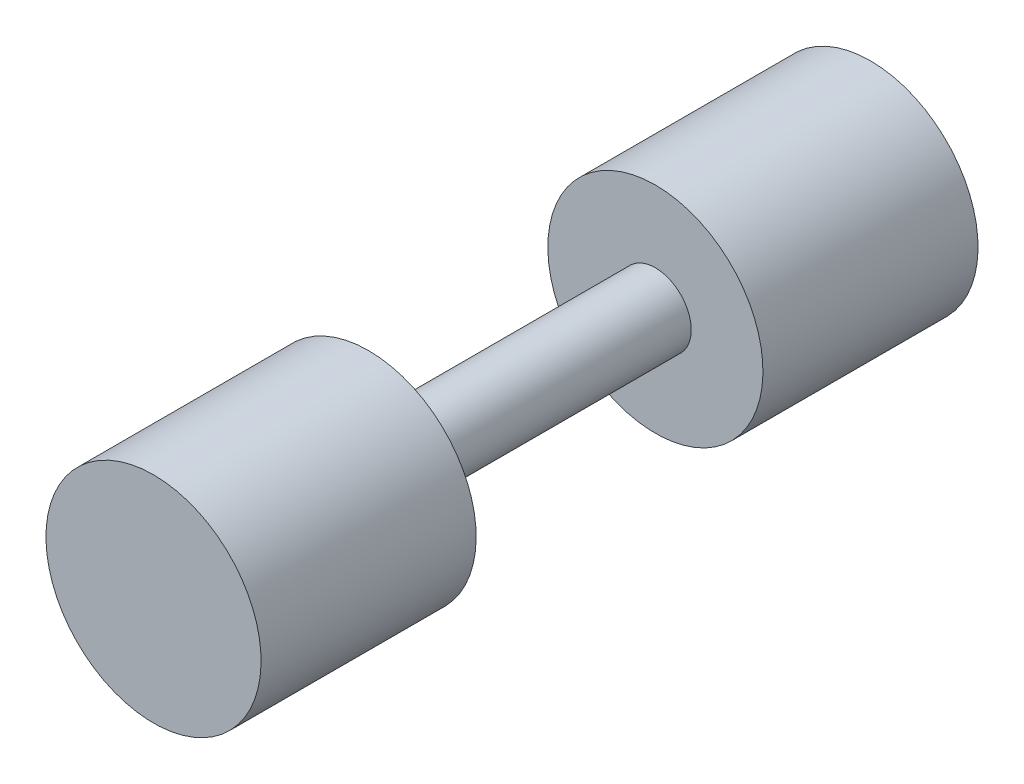
ISO-10303-21;
HEADER;
FILE_DESCRIPTION(('STEP AP214'),'2;1');
FILE_NAME('part.step','',(''),(''),'','','');
FILE_SCHEMA(('AUTOMOTIVE_DESIGN { 1 0 10303 214 1 1 1 1 }'));
ENDSEC;
DATA;
#1=APPLICATION_CONTEXT('core data for automotive mechanical design processes');
#2=APPLICATION_PROTOCOL_DEFINITION('international standard','automotive_design',2000,#1);
#3=PRODUCT_CONTEXT('',#1,'mechanical');
#4=PRODUCT('Part','Part','',(#3));
#5=PRODUCT_RELATED_PRODUCT_CATEGORY('part','',(#4));
#6=PRODUCT_DEFINITION_FORMATION('','',#4);
#7=PRODUCT_DEFINITION_CONTEXT('part definition',#1,'design');
#8=PRODUCT_DEFINITION('design','',#6,#7);
#9=PRODUCT_DEFINITION_SHAPE('','',#8);
#10=(LENGTH_UNIT() NAMED_UNIT(*) SI_UNIT(.MILLI.,.METRE.));
#11=(NAMED_UNIT(*) PLANE_ANGLE_UNIT() SI_UNIT($,.RADIAN.));
#12=(NAMED_UNIT(*) SI_UNIT($,.STERADIAN.) SOLID_ANGLE_UNIT());
#13=UNCERTAINTY_MEASURE_WITH_UNIT(LENGTH_MEASURE(1.E-05),#10,'distance_accuracy_value','');
#14=(GEOMETRIC_REPRESENTATION_CONTEXT(3) GLOBAL_UNCERTAINTY_ASSIGNED_CONTEXT((#13)) GLOBAL_UNIT_ASSIGNED_CONTEXT((#10,
#11,#12)) REPRESENTATION_CONTEXT('',''));
#15=CARTESIAN_POINT('',(0.,0.,0.));
#16=DIRECTION('',(0.,0.,1.));
#17=DIRECTION('',(1.,0.,0.));
#18=AXIS2_PLACEMENT_3D('',#15,#16,#17);
#19=CARTESIAN_POINT('',(0.,0.,-63.5));
#20=DIRECTION('',(0.,0.,-1.));
#21=DIRECTION('',(0.,1.,0.));
#22=AXIS2_PLACEMENT_3D('',#19,#20,#21);
#23=CYLINDRICAL_SURFACE('',#22,19.05);
#24=CARTESIAN_POINT('',(0.,0.,-25.4));
#25=DIRECTION('',(0.,0.,-1.));
#26=DIRECTION('',(0.,1.,0.));
#27=AXIS2_PLACEMENT_3D('',#24,#25,#26);
#28=CIRCLE('',#27,19.05);
#29=CARTESIAN_POINT('',(0.,19.05,-25.4));
#30=VERTEX_POINT('',#29);
#31=EDGE_CURVE('E52',#30,#30,#28,.T.);
#32=ORIENTED_EDGE('',*,*,#31,.T.);
#33=EDGE_LOOP('',(#32));
#34=FACE_BOUND('',#33,.T.);
#35=CARTESIAN_POINT('',(0.,0.,-63.5));
#36=DIRECTION('',(0.,0.,-1.));
#37=DIRECTION('',(0.,1.,0.));
#38=AXIS2_PLACEMENT_3D('',#35,#36,#37);
#39=CIRCLE('',#38,19.05);
#40=CARTESIAN_POINT('',(0.,19.05,-63.5));
#41=VERTEX_POINT('',#40);
#42=EDGE_CURVE('E10',#41,#41,#39,.T.);
#43=ORIENTED_EDGE('',*,*,#42,.F.);
#44=EDGE_LOOP('',(#43));
#45=FACE_BOUND('',#44,.T.);
#46=ADVANCED_FACE('F30',(#34,#45),#23,.T.);
#47=CARTESIAN_POINT('',(0.,19.05,-63.5));
#48=DIRECTION('',(0.,0.,-1.));
#49=DIRECTION('',(0.,1.,0.));
#50=AXIS2_PLACEMENT_3D('',#47,#48,#49);
#51=PLANE('',#50);
#52=ORIENTED_EDGE('',*,*,#42,.T.);
#53=EDGE_LOOP('',(#52));
#54=FACE_BOUND('',#53,.T.);
#55=ADVANCED_FACE('F70',(#54),#51,.T.);
#56=CARTESIAN_POINT('',(0.,0.,63.5));
#57=DIRECTION('',(0.,0.,1.));
#58=DIRECTION('',(0.,-1.,0.));
#59=AXIS2_PLACEMENT_3D('',#56,#57,#58);
#60=PLANE('',#59);
#61=CARTESIAN_POINT('',(0.,0.,63.5));
#62=DIRECTION('',(0.,0.,-1.));
#63=DIRECTION('',(0.,1.,0.));
#64=AXIS2_PLACEMENT_3D('',#61,#62,#63);
#65=CIRCLE('',#64,19.05);
#66=CARTESIAN_POINT('',(0.,19.05,63.5));
#67=VERTEX_POINT('',#66);
#68=EDGE_CURVE('E36',#67,#67,#65,.T.);
#69=ORIENTED_EDGE('',*,*,#68,.F.);
#70=EDGE_LOOP('',(#69));
#71=FACE_BOUND('',#70,.T.);
#72=ADVANCED_FACE('F74',(#71),#60,.T.);
#73=CARTESIAN_POINT('',(0.,0.,-63.5));
#74=DIRECTION('',(0.,0.,-1.));
#75=DIRECTION('',(0.,1.,0.));
#76=AXIS2_PLACEMENT_3D('',#73,#74,#75);
#77=CYLINDRICAL_SURFACE('',#76,19.05);
#78=ORIENTED_EDGE('',*,*,#68,.T.);
#79=EDGE_LOOP('',(#78));
#80=FACE_BOUND('',#79,.T.);
#81=CARTESIAN_POINT('',(0.,0.,25.4));
#82=DIRECTION('',(0.,0.,-1.));
#83=DIRECTION('',(0.,1.,0.));
#84=AXIS2_PLACEMENT_3D('',#81,#82,#83);
#85=CIRCLE('',#84,19.05);
#86=CARTESIAN_POINT('',(0.,19.05,25.4));
#87=VERTEX_POINT('',#86);
#88=EDGE_CURVE('E40',#87,#87,#85,.T.);
#89=ORIENTED_EDGE('',*,*,#88,.F.);
#90=EDGE_LOOP('',(#89));
#91=FACE_BOUND('',#90,.T.);
#92=ADVANCED_FACE('F78',(#80,#91),#77,.T.);
#93=CARTESIAN_POINT('',(0.,19.05,25.4));
#94=DIRECTION('',(0.,0.,-1.));
#95=DIRECTION('',(0.,1.,0.));
#96=AXIS2_PLACEMENT_3D('',#93,#94,#95);
#97=PLANE('',#96);
#98=ORIENTED_EDGE('',*,*,#88,.T.);
#99=EDGE_LOOP('',(#98));
#100=FACE_BOUND('',#99,.T.);
#101=CARTESIAN_POINT('',(0.,0.,25.4));
#102=DIRECTION('',(0.,0.,-1.));
#103=DIRECTION('',(0.,1.,0.));
#104=AXIS2_PLACEMENT_3D('',#101,#102,#103);
#105=CIRCLE('',#104,6.35000000000001);
#106=CARTESIAN_POINT('',(0.,6.34999999999999,25.4));
#107=VERTEX_POINT('',#106);
#108=EDGE_CURVE('E44',#107,#107,#105,.T.);
#109=ORIENTED_EDGE('',*,*,#108,.F.);
#110=EDGE_LOOP('',(#109));
#111=FACE_BOUND('',#110,.T.);
#112=ADVANCED_FACE('F66',(#100,#111),#97,.T.);
#113=CARTESIAN_POINT('',(0.,0.,-63.5));
#114=DIRECTION('',(0.,0.,-1.));
#115=DIRECTION('',(0.,1.,0.));
#116=AXIS2_PLACEMENT_3D('',#113,#114,#115);
#117=CYLINDRICAL_SURFACE('',#116,6.35000000000001);
#118=ORIENTED_EDGE('',*,*,#108,.T.);
#119=EDGE_LOOP('',(#118));
#120=FACE_BOUND('',#119,.T.);
#121=CARTESIAN_POINT('',(0.,0.,-25.4));
#122=DIRECTION('',(0.,0.,-1.));
#123=DIRECTION('',(0.,1.,0.));
#124=AXIS2_PLACEMENT_3D('',#121,#122,#123);
#125=CIRCLE('',#124,6.35000000000001);
#126=CARTESIAN_POINT('',(0.,6.34999999999999,-25.4));
#127=VERTEX_POINT('',#126);
#128=EDGE_CURVE('E49',#127,#127,#125,.T.);
#129=ORIENTED_EDGE('',*,*,#128,.F.);
#130=EDGE_LOOP('',(#129));
#131=FACE_BOUND('',#130,.T.);
#132=ADVANCED_FACE('F60',(#120,#131),#117,.T.);
#133=CARTESIAN_POINT('',(0.,6.34999999999999,-25.4));
#134=DIRECTION('',(0.,0.,1.));
#135=DIRECTION('',(0.,-1.,0.));
#136=AXIS2_PLACEMENT_3D('',#133,#134,#135);
#137=PLANE('',#136);
#138=ORIENTED_EDGE('',*,*,#128,.T.);
#139=EDGE_LOOP('',(#138));
#140=FACE_BOUND('',#139,.T.);
#141=ORIENTED_EDGE('',*,*,#31,.F.);
#142=EDGE_LOOP('',(#141));
#143=FACE_BOUND('',#142,.T.);
#144=ADVANCED_FACE('F58',(#140,#143),#137,.T.);
#145=CLOSED_SHELL('',(#46,#55,#72,#92,#112,#132,#144));
#146=MANIFOLD_SOLID_BREP('B2',#145);
#147=ADVANCED_BREP_SHAPE_REPRESENTATION('',(#18,#146),#14);
#148=SHAPE_DEFINITION_REPRESENTATION(#9,#147);
ENDSEC;
END-ISO-10303-21;
